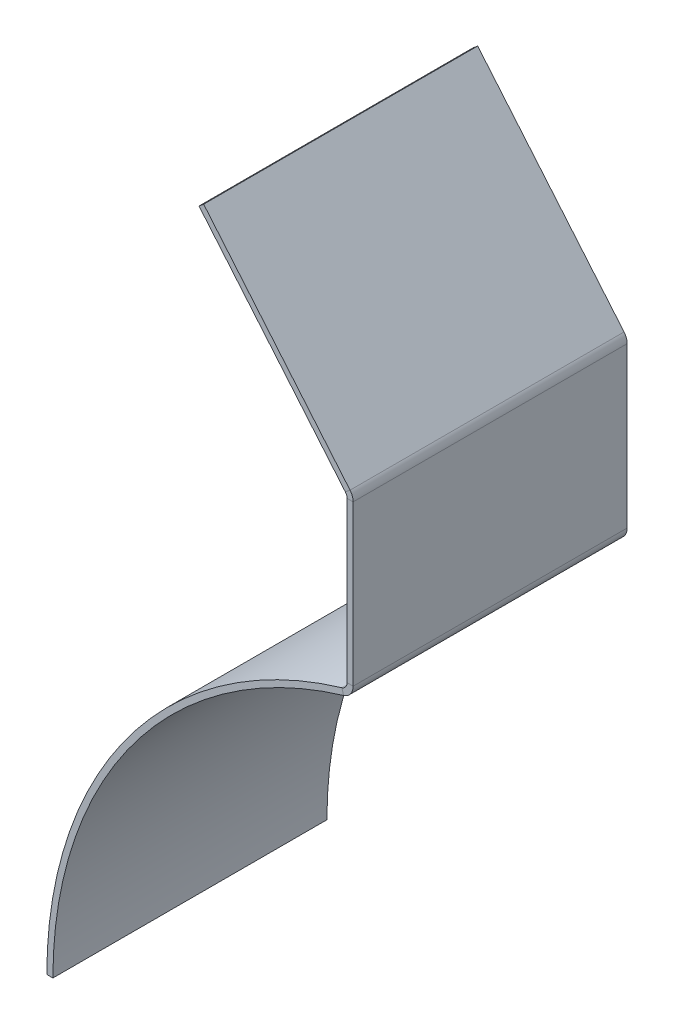
ISO-10303-21;
HEADER;
FILE_DESCRIPTION(('STEP AP214'),'2;1');
FILE_NAME('part.step','',(''),(''),'','','');
FILE_SCHEMA(('AUTOMOTIVE_DESIGN { 1 0 10303 214 1 1 1 1 }'));
ENDSEC;
DATA;
#1=APPLICATION_CONTEXT('core data for automotive mechanical design processes');
#2=APPLICATION_PROTOCOL_DEFINITION('international standard','automotive_design',2000,#1);
#3=PRODUCT_CONTEXT('',#1,'mechanical');
#4=PRODUCT('Part','Part','',(#3));
#5=PRODUCT_RELATED_PRODUCT_CATEGORY('part','',(#4));
#6=PRODUCT_DEFINITION_FORMATION('','',#4);
#7=PRODUCT_DEFINITION_CONTEXT('part definition',#1,'design');
#8=PRODUCT_DEFINITION('design','',#6,#7);
#9=PRODUCT_DEFINITION_SHAPE('','',#8);
#10=(LENGTH_UNIT() NAMED_UNIT(*) SI_UNIT(.MILLI.,.METRE.));
#11=(NAMED_UNIT(*) PLANE_ANGLE_UNIT() SI_UNIT($,.RADIAN.));
#12=(NAMED_UNIT(*) SI_UNIT($,.STERADIAN.) SOLID_ANGLE_UNIT());
#13=UNCERTAINTY_MEASURE_WITH_UNIT(LENGTH_MEASURE(1.E-05),#10,'distance_accuracy_value','');
#14=(GEOMETRIC_REPRESENTATION_CONTEXT(3) GLOBAL_UNCERTAINTY_ASSIGNED_CONTEXT((#13)) GLOBAL_UNIT_ASSIGNED_CONTEXT((#10,
#11,#12)) REPRESENTATION_CONTEXT('',''));
#15=CARTESIAN_POINT('',(0.,0.,0.));
#16=DIRECTION('',(0.,0.,1.));
#17=DIRECTION('',(1.,0.,0.));
#18=AXIS2_PLACEMENT_3D('',#15,#16,#17);
#19=CARTESIAN_POINT('',(-46.6343359967597,173.610704407755,0.));
#20=DIRECTION('',(0.,0.,-1.));
#21=DIRECTION('',(-1.,0.,0.));
#22=AXIS2_PLACEMENT_3D('',#19,#20,#21);
#23=PLANE('',#22);
#24=DIRECTION('',(-2.70456049815286E-05,0.999999999634268,0.));
#25=VECTOR('',#24,1.);
#26=CARTESIAN_POINT('',(-49.2864988407369,0.674769126515573,0.));
#27=LINE('',#26,#25);
#28=CARTESIAN_POINT('',(-49.2931259037528,245.707668850982,0.));
#29=VERTEX_POINT('',#28);
#30=CARTESIAN_POINT('',(-49.2912400011612,175.977204615524,0.));
#31=VERTEX_POINT('',#30);
#32=EDGE_CURVE('E265',#29,#31,#27,.F.);
#33=ORIENTED_EDGE('',*,*,#32,.F.);
#34=DIRECTION('',(0.999999999634268,2.70456049856609E-05,0.));
#35=VECTOR('',#34,1.);
#36=CARTESIAN_POINT('',(-49.2931259037528,245.707668850982,0.));
#37=LINE('',#36,#35);
#38=CARTESIAN_POINT('',(-46.6362859047245,245.707740706827,0.));
#39=VERTEX_POINT('',#38);
#40=EDGE_CURVE('E235',#29,#39,#37,.T.);
#41=ORIENTED_EDGE('',*,*,#40,.T.);
#42=DIRECTION('',(2.70456049815286E-05,-0.999999999634268,0.));
#43=VECTOR('',#42,1.);
#44=CARTESIAN_POINT('',(-46.6343359967597,173.610704407755,0.));
#45=LINE('',#44,#43);
#46=CARTESIAN_POINT('',(-46.6344000021329,175.977276471369,0.));
#47=VERTEX_POINT('',#46);
#48=EDGE_CURVE('E257',#39,#47,#45,.T.);
#49=ORIENTED_EDGE('',*,*,#48,.T.);
#50=DIRECTION('',(0.999999999634268,2.70456049815286E-05,0.));
#51=VECTOR('',#50,1.);
#52=CARTESIAN_POINT('',(-49.2912400011612,175.977204615524,0.));
#53=LINE('',#52,#51);
#54=EDGE_CURVE('E276',#31,#47,#53,.T.);
#55=ORIENTED_EDGE('',*,*,#54,.F.);
#56=EDGE_LOOP('',(#33,#41,#49,#55));
#57=FACE_BOUND('',#56,.T.);
#58=ADVANCED_FACE('F81',(#57),#23,.T.);
#59=CARTESIAN_POINT('',(-46.6296588417086,0.674840982360713,0.));
#60=DIRECTION('',(0.999999999634268,2.70456049815286E-05,0.));
#61=DIRECTION('',(-2.70456049815286E-05,0.999999999634268,0.));
#62=AXIS2_PLACEMENT_3D('',#59,#60,#61);
#63=PLANE('',#62);
#64=ORIENTED_EDGE('',*,*,#48,.F.);
#65=DIRECTION('',(0.,0.,-1.));
#66=VECTOR('',#65,1.);
#67=CARTESIAN_POINT('',(-46.6362859047245,245.707740706827,0.));
#68=LINE('',#67,#66);
#69=CARTESIAN_POINT('',(-46.6362859047245,245.707740706827,119.6975));
#70=VERTEX_POINT('',#69);
#71=EDGE_CURVE('E228',#39,#70,#68,.F.);
#72=ORIENTED_EDGE('',*,*,#71,.T.);
#73=DIRECTION('',(-2.70456049815286E-05,0.999999999634268,0.));
#74=VECTOR('',#73,1.);
#75=CARTESIAN_POINT('',(-46.636343312163,247.830356877054,119.6975));
#76=LINE('',#75,#74);
#77=CARTESIAN_POINT('',(-46.6344000021329,175.977276471369,119.6975));
#78=VERTEX_POINT('',#77);
#79=EDGE_CURVE('E261',#78,#70,#76,.T.);
#80=ORIENTED_EDGE('',*,*,#79,.F.);
#81=DIRECTION('',(0.,0.,-1.));
#82=VECTOR('',#81,1.);
#83=CARTESIAN_POINT('',(-46.6344000021329,175.977276471369,0.));
#84=LINE('',#83,#82);
#85=EDGE_CURVE('E272',#78,#47,#84,.T.);
#86=ORIENTED_EDGE('',*,*,#85,.T.);
#87=EDGE_LOOP('',(#64,#72,#80,#86));
#88=FACE_BOUND('',#87,.T.);
#89=ADVANCED_FACE('F369',(#88),#63,.T.);
#90=CARTESIAN_POINT('',(-49.2864988407369,0.674769126515573,0.));
#91=DIRECTION('',(0.999999999634268,2.70456049815286E-05,0.));
#92=DIRECTION('',(-2.70456049815286E-05,0.999999999634268,0.));
#93=AXIS2_PLACEMENT_3D('',#90,#91,#92);
#94=PLANE('',#93);
#95=DIRECTION('',(0.,0.,-1.));
#96=VECTOR('',#95,1.);
#97=CARTESIAN_POINT('',(-49.2931259037528,245.707668850982,0.));
#98=LINE('',#97,#96);
#99=CARTESIAN_POINT('',(-49.2931259037528,245.707668850982,119.6975));
#100=VERTEX_POINT('',#99);
#101=EDGE_CURVE('E243',#29,#100,#98,.F.);
#102=ORIENTED_EDGE('',*,*,#101,.F.);
#103=ORIENTED_EDGE('',*,*,#32,.T.);
#104=DIRECTION('',(0.,0.,1.));
#105=VECTOR('',#104,1.);
#106=CARTESIAN_POINT('',(-49.2912400011612,175.977204615524,119.6975));
#107=LINE('',#106,#105);
#108=CARTESIAN_POINT('',(-49.2912400011612,175.977204615524,119.6975));
#109=VERTEX_POINT('',#108);
#110=EDGE_CURVE('E280',#109,#31,#107,.F.);
#111=ORIENTED_EDGE('',*,*,#110,.F.);
#112=DIRECTION('',(2.70456049815286E-05,-0.999999999634268,0.));
#113=VECTOR('',#112,1.);
#114=CARTESIAN_POINT('',(-49.2864988407369,0.674769126515596,119.6975));
#115=LINE('',#114,#113);
#116=EDGE_CURVE('E268',#109,#100,#115,.F.);
#117=ORIENTED_EDGE('',*,*,#116,.T.);
#118=EDGE_LOOP('',(#102,#103,#111,#117));
#119=FACE_BOUND('',#118,.T.);
#120=ADVANCED_FACE('F358',(#119),#94,.F.);
#121=CARTESIAN_POINT('',(0.,0.,119.6975));
#122=DIRECTION('',(0.,0.,-1.));
#123=DIRECTION('',(-1.,0.,0.));
#124=AXIS2_PLACEMENT_3D('',#121,#122,#123);
#125=CYLINDRICAL_SURFACE('',#124,180.45684);
#126=CARTESIAN_POINT('',(0.,0.,0.));
#127=DIRECTION('',(0.,0.,1.));
#128=DIRECTION('',(1.,0.,0.));
#129=AXIS2_PLACEMENT_3D('',#126,#127,#128);
#130=CIRCLE('',#129,180.45684);
#131=CARTESIAN_POINT('',(-51.5590971428571,172.934469104916,0.));
#132=VERTEX_POINT('',#131);
#133=CARTESIAN_POINT('',(-180.45684,0.,0.));
#134=VERTEX_POINT('',#133);
#135=EDGE_CURVE('E291',#132,#134,#130,.T.);
#136=ORIENTED_EDGE('',*,*,#135,.T.);
#137=DIRECTION('',(0.,0.,-1.));
#138=VECTOR('',#137,1.);
#139=CARTESIAN_POINT('',(-180.45684,0.,119.6975));
#140=LINE('',#139,#138);
#141=CARTESIAN_POINT('',(-180.45684,0.,119.6975));
#142=VERTEX_POINT('',#141);
#143=EDGE_CURVE('E13',#142,#134,#140,.T.);
#144=ORIENTED_EDGE('',*,*,#143,.F.);
#145=CARTESIAN_POINT('',(0.,0.,119.6975));
#146=DIRECTION('',(0.,0.,1.));
#147=DIRECTION('',(1.,0.,0.));
#148=AXIS2_PLACEMENT_3D('',#145,#146,#147);
#149=CIRCLE('',#148,180.45684);
#150=CARTESIAN_POINT('',(-51.5590971428571,172.934469104916,119.6975));
#151=VERTEX_POINT('',#150);
#152=EDGE_CURVE('E106',#151,#142,#149,.T.);
#153=ORIENTED_EDGE('',*,*,#152,.F.);
#154=DIRECTION('',(0.,0.,-1.));
#155=VECTOR('',#154,1.);
#156=CARTESIAN_POINT('',(-51.5590971428571,172.934469104916,119.6975));
#157=LINE('',#156,#155);
#158=EDGE_CURVE('E122',#151,#132,#157,.T.);
#159=ORIENTED_EDGE('',*,*,#158,.T.);
#160=EDGE_LOOP('',(#136,#144,#153,#159));
#161=FACE_BOUND('',#160,.T.);
#162=ADVANCED_FACE('F83',(#161),#125,.T.);
#163=CARTESIAN_POINT('',(-177.8,0.,119.6975));
#164=DIRECTION('',(0.,-1.,0.));
#165=DIRECTION('',(1.,0.,0.));
#166=AXIS2_PLACEMENT_3D('',#163,#164,#165);
#167=PLANE('',#166);
#168=DIRECTION('',(-1.,0.,0.));
#169=VECTOR('',#168,1.);
#170=CARTESIAN_POINT('',(-177.8,0.,0.));
#171=LINE('',#170,#169);
#172=CARTESIAN_POINT('',(-177.8,0.,0.));
#173=VERTEX_POINT('',#172);
#174=EDGE_CURVE('E320',#173,#134,#171,.T.);
#175=ORIENTED_EDGE('',*,*,#174,.F.);
#176=DIRECTION('',(0.,0.,-1.));
#177=VECTOR('',#176,1.);
#178=CARTESIAN_POINT('',(-177.8,0.,119.6975));
#179=LINE('',#178,#177);
#180=CARTESIAN_POINT('',(-177.8,0.,119.6975));
#181=VERTEX_POINT('',#180);
#182=EDGE_CURVE('E90',#181,#173,#179,.T.);
#183=ORIENTED_EDGE('',*,*,#182,.F.);
#184=DIRECTION('',(-1.,0.,0.));
#185=VECTOR('',#184,1.);
#186=CARTESIAN_POINT('',(-177.8,0.,119.6975));
#187=LINE('',#186,#185);
#188=EDGE_CURVE('E305',#181,#142,#187,.T.);
#189=ORIENTED_EDGE('',*,*,#188,.T.);
#190=ORIENTED_EDGE('',*,*,#143,.T.);
#191=EDGE_LOOP('',(#175,#183,#189,#190));
#192=FACE_BOUND('',#191,.T.);
#193=ADVANCED_FACE('F342',(#192),#167,.T.);
#194=CARTESIAN_POINT('',(0.,0.,119.6975));
#195=DIRECTION('',(0.,0.,-1.));
#196=DIRECTION('',(-1.,0.,0.));
#197=AXIS2_PLACEMENT_3D('',#194,#195,#196);
#198=CYLINDRICAL_SURFACE('',#197,177.8);
#199=CARTESIAN_POINT('',(0.,0.,0.));
#200=DIRECTION('',(0.,0.,1.));
#201=DIRECTION('',(1.,0.,0.));
#202=AXIS2_PLACEMENT_3D('',#199,#200,#201);
#203=CIRCLE('',#202,177.8);
#204=CARTESIAN_POINT('',(-50.8,170.388379885484,0.));
#205=VERTEX_POINT('',#204);
#206=EDGE_CURVE('E324',#205,#173,#203,.T.);
#207=ORIENTED_EDGE('',*,*,#206,.F.);
#208=DIRECTION('',(0.,0.,-1.));
#209=VECTOR('',#208,1.);
#210=CARTESIAN_POINT('',(-50.8,170.388379885484,119.6975));
#211=LINE('',#210,#209);
#212=CARTESIAN_POINT('',(-50.8,170.388379885484,119.6975));
#213=VERTEX_POINT('',#212);
#214=EDGE_CURVE('E332',#213,#205,#211,.T.);
#215=ORIENTED_EDGE('',*,*,#214,.F.);
#216=CARTESIAN_POINT('',(0.,0.,119.6975));
#217=DIRECTION('',(0.,0.,1.));
#218=DIRECTION('',(1.,0.,0.));
#219=AXIS2_PLACEMENT_3D('',#216,#217,#218);
#220=CIRCLE('',#219,177.8);
#221=EDGE_CURVE('E310',#213,#181,#220,.T.);
#222=ORIENTED_EDGE('',*,*,#221,.T.);
#223=ORIENTED_EDGE('',*,*,#182,.T.);
#224=EDGE_LOOP('',(#207,#215,#222,#223));
#225=FACE_BOUND('',#224,.T.);
#226=ADVANCED_FACE('F339',(#225),#198,.F.);
#227=CARTESIAN_POINT('',(0.,0.,119.6975));
#228=DIRECTION('',(0.,0.,1.));
#229=DIRECTION('',(1.,0.,0.));
#230=AXIS2_PLACEMENT_3D('',#227,#228,#229);
#231=PLANE('',#230);
#232=ORIENTED_EDGE('',*,*,#152,.T.);
#233=ORIENTED_EDGE('',*,*,#188,.F.);
#234=ORIENTED_EDGE('',*,*,#221,.F.);
#235=DIRECTION('',(0.285714285714285,-0.95831484749991,0.));
#236=VECTOR('',#235,1.);
#237=CARTESIAN_POINT('',(-51.5590971428571,172.934469104916,119.6975));
#238=LINE('',#237,#236);
#239=EDGE_CURVE('E314',#151,#213,#238,.T.);
#240=ORIENTED_EDGE('',*,*,#239,.F.);
#241=EDGE_LOOP('',(#232,#233,#234,#240));
#242=FACE_BOUND('',#241,.T.);
#243=ADVANCED_FACE('F381',(#242),#231,.T.);
#244=CARTESIAN_POINT('',(0.,0.,0.));
#245=DIRECTION('',(0.,0.,1.));
#246=DIRECTION('',(1.,0.,0.));
#247=AXIS2_PLACEMENT_3D('',#244,#245,#246);
#248=PLANE('',#247);
#249=ORIENTED_EDGE('',*,*,#135,.F.);
#250=DIRECTION('',(0.285714285714285,-0.95831484749991,0.));
#251=VECTOR('',#250,1.);
#252=CARTESIAN_POINT('',(-51.5590971428571,172.934469104916,0.));
#253=LINE('',#252,#251);
#254=EDGE_CURVE('E306',#132,#205,#253,.T.);
#255=ORIENTED_EDGE('',*,*,#254,.T.);
#256=ORIENTED_EDGE('',*,*,#206,.T.);
#257=ORIENTED_EDGE('',*,*,#174,.T.);
#258=EDGE_LOOP('',(#249,#255,#256,#257));
#259=FACE_BOUND('',#258,.T.);
#260=ADVANCED_FACE('F344',(#259),#248,.F.);
#261=CARTESIAN_POINT('',(-52.46624,175.977118745728,119.6975));
#262=DIRECTION('',(0.,0.,1.));
#263=DIRECTION('',(1.,0.,0.));
#264=AXIS2_PLACEMENT_3D('',#261,#262,#263);
#265=PLANE('',#264);
#266=DIRECTION('',(0.999999999634268,2.70456049815286E-05,0.));
#267=VECTOR('',#266,1.);
#268=CARTESIAN_POINT('',(-46.6344000021329,175.977276471369,119.6975));
#269=LINE('',#268,#267);
#270=EDGE_CURVE('E253',#109,#78,#269,.T.);
#271=ORIENTED_EDGE('',*,*,#270,.F.);
#272=CARTESIAN_POINT('',(-52.46624,175.977118745728,119.6975));
#273=DIRECTION('',(0.,0.,-1.));
#274=DIRECTION('',(-1.,0.,0.));
#275=AXIS2_PLACEMENT_3D('',#272,#273,#274);
#276=CIRCLE('',#275,3.17499999999999);
#277=EDGE_CURVE('E296',#151,#109,#276,.F.);
#278=ORIENTED_EDGE('',*,*,#277,.F.);
#279=ORIENTED_EDGE('',*,*,#239,.T.);
#280=CARTESIAN_POINT('',(-52.46624,175.977118745728,119.6975));
#281=DIRECTION('',(0.,0.,-1.));
#282=DIRECTION('',(-1.,0.,0.));
#283=AXIS2_PLACEMENT_3D('',#280,#281,#282);
#284=CIRCLE('',#283,5.83183999999999);
#285=EDGE_CURVE('E287',#213,#78,#284,.F.);
#286=ORIENTED_EDGE('',*,*,#285,.T.);
#287=EDGE_LOOP('',(#271,#278,#279,#286));
#288=FACE_BOUND('',#287,.T.);
#289=ADVANCED_FACE('F380',(#288),#265,.T.);
#290=CARTESIAN_POINT('',(-52.46624,175.977118745728,0.));
#291=DIRECTION('',(0.,0.,1.));
#292=DIRECTION('',(1.,0.,0.));
#293=AXIS2_PLACEMENT_3D('',#290,#291,#292);
#294=PLANE('',#293);
#295=CARTESIAN_POINT('',(-52.46624,175.977118745728,0.));
#296=DIRECTION('',(0.,0.,-1.));
#297=DIRECTION('',(-1.,0.,0.));
#298=AXIS2_PLACEMENT_3D('',#295,#296,#297);
#299=CIRCLE('',#298,3.17499999999999);
#300=EDGE_CURVE('E260',#31,#132,#299,.T.);
#301=ORIENTED_EDGE('',*,*,#300,.F.);
#302=ORIENTED_EDGE('',*,*,#54,.T.);
#303=CARTESIAN_POINT('',(-52.46624,175.977118745728,0.));
#304=DIRECTION('',(0.,0.,-1.));
#305=DIRECTION('',(-1.,0.,0.));
#306=AXIS2_PLACEMENT_3D('',#303,#304,#305);
#307=CIRCLE('',#306,5.83183999999999);
#308=EDGE_CURVE('E292',#47,#205,#307,.T.);
#309=ORIENTED_EDGE('',*,*,#308,.T.);
#310=ORIENTED_EDGE('',*,*,#254,.F.);
#311=EDGE_LOOP('',(#301,#302,#309,#310));
#312=FACE_BOUND('',#311,.T.);
#313=ADVANCED_FACE('F348',(#312),#294,.F.);
#314=CARTESIAN_POINT('',(-52.46624,175.977118745728,0.));
#315=DIRECTION('',(0.,0.,-1.));
#316=DIRECTION('',(0.999999999634268,2.70456049815286E-05,0.));
#317=AXIS2_PLACEMENT_3D('',#314,#315,#316);
#318=CYLINDRICAL_SURFACE('',#317,5.83183999999999);
#319=ORIENTED_EDGE('',*,*,#214,.T.);
#320=ORIENTED_EDGE('',*,*,#308,.F.);
#321=ORIENTED_EDGE('',*,*,#85,.F.);
#322=ORIENTED_EDGE('',*,*,#285,.F.);
#323=EDGE_LOOP('',(#319,#320,#321,#322));
#324=FACE_BOUND('',#323,.T.);
#325=ADVANCED_FACE('F378',(#324),#318,.T.);
#326=CARTESIAN_POINT('',(-52.46624,175.977118745728,0.));
#327=DIRECTION('',(0.,0.,-1.));
#328=DIRECTION('',(0.999999999634268,2.70456049815286E-05,0.));
#329=AXIS2_PLACEMENT_3D('',#326,#327,#328);
#330=CYLINDRICAL_SURFACE('',#329,3.17499999999999);
#331=ORIENTED_EDGE('',*,*,#158,.F.);
#332=ORIENTED_EDGE('',*,*,#277,.T.);
#333=ORIENTED_EDGE('',*,*,#110,.T.);
#334=ORIENTED_EDGE('',*,*,#300,.T.);
#335=EDGE_LOOP('',(#331,#332,#333,#334));
#336=FACE_BOUND('',#335,.T.);
#337=ADVANCED_FACE('F352',(#336),#330,.F.);
#338=CARTESIAN_POINT('',(-46.636343312163,247.830356877054,119.6975));
#339=DIRECTION('',(0.,0.,1.));
#340=DIRECTION('',(0.,-1.,0.));
#341=AXIS2_PLACEMENT_3D('',#338,#339,#340);
#342=PLANE('',#341);
#343=DIRECTION('',(0.999999999634268,2.70456049856609E-05,0.));
#344=VECTOR('',#343,1.);
#345=CARTESIAN_POINT('',(-49.2931259037528,245.707668850982,119.6975));
#346=LINE('',#345,#344);
#347=EDGE_CURVE('E250',#100,#70,#346,.T.);
#348=ORIENTED_EDGE('',*,*,#347,.F.);
#349=ORIENTED_EDGE('',*,*,#116,.F.);
#350=ORIENTED_EDGE('',*,*,#270,.T.);
#351=ORIENTED_EDGE('',*,*,#79,.T.);
#352=EDGE_LOOP('',(#348,#349,#350,#351));
#353=FACE_BOUND('',#352,.T.);
#354=ADVANCED_FACE('F362',(#353),#342,.T.);
#355=CARTESIAN_POINT('',(-52.4681259025916,245.707582981186,119.6975));
#356=DIRECTION('',(0.,0.,1.));
#357=DIRECTION('',(1.,0.,0.));
#358=AXIS2_PLACEMENT_3D('',#355,#356,#357);
#359=PLANE('',#358);
#360=DIRECTION('',(-0.766027058259036,-0.642808327586854,0.));
#361=VECTOR('',#360,1.);
#362=CARTESIAN_POINT('',(-48.0007786631542,249.456338298341,119.6975));
#363=LINE('',#362,#361);
#364=CARTESIAN_POINT('',(-50.0359899926192,247.748499421275,119.6975));
#365=VERTEX_POINT('',#364);
#366=CARTESIAN_POINT('',(-48.0007786631542,249.456338298341,119.6975));
#367=VERTEX_POINT('',#366);
#368=EDGE_CURVE('E202',#365,#367,#363,.F.);
#369=ORIENTED_EDGE('',*,*,#368,.F.);
#370=CARTESIAN_POINT('',(-52.4681259025916,245.707582981186,119.6975));
#371=DIRECTION('',(0.,0.,-1.));
#372=DIRECTION('',(-1.,0.,0.));
#373=AXIS2_PLACEMENT_3D('',#370,#371,#372);
#374=CIRCLE('',#373,3.17500000000002);
#375=EDGE_CURVE('E239',#100,#365,#374,.F.);
#376=ORIENTED_EDGE('',*,*,#375,.F.);
#377=ORIENTED_EDGE('',*,*,#347,.T.);
#378=CARTESIAN_POINT('',(-52.4681259025916,245.707582981186,119.6975));
#379=DIRECTION('',(0.,0.,-1.));
#380=DIRECTION('',(-1.,0.,0.));
#381=AXIS2_PLACEMENT_3D('',#378,#379,#380);
#382=CIRCLE('',#381,5.83184000000002);
#383=EDGE_CURVE('E97',#70,#367,#382,.F.);
#384=ORIENTED_EDGE('',*,*,#383,.T.);
#385=EDGE_LOOP('',(#369,#376,#377,#384));
#386=FACE_BOUND('',#385,.T.);
#387=ADVANCED_FACE('F366',(#386),#359,.T.);
#388=CARTESIAN_POINT('',(-52.4681259025916,245.707582981186,0.));
#389=DIRECTION('',(0.,0.,1.));
#390=DIRECTION('',(1.,0.,0.));
#391=AXIS2_PLACEMENT_3D('',#388,#389,#390);
#392=PLANE('',#391);
#393=CARTESIAN_POINT('',(-52.4681259025916,245.707582981186,0.));
#394=DIRECTION('',(0.,0.,-1.));
#395=DIRECTION('',(-1.,0.,0.));
#396=AXIS2_PLACEMENT_3D('',#393,#394,#395);
#397=CIRCLE('',#396,3.17500000000002);
#398=CARTESIAN_POINT('',(-50.0359899926192,247.748499421275,0.));
#399=VERTEX_POINT('',#398);
#400=EDGE_CURVE('E246',#399,#29,#397,.T.);
#401=ORIENTED_EDGE('',*,*,#400,.F.);
#402=DIRECTION('',(-0.766027058259036,-0.642808327586854,0.));
#403=VECTOR('',#402,1.);
#404=CARTESIAN_POINT('',(-50.0359899926192,247.748499421275,0.));
#405=LINE('',#404,#403);
#406=CARTESIAN_POINT('',(-48.0007786631543,249.456338298341,0.));
#407=VERTEX_POINT('',#406);
#408=EDGE_CURVE('E219',#399,#407,#405,.F.);
#409=ORIENTED_EDGE('',*,*,#408,.T.);
#410=CARTESIAN_POINT('',(-52.4681259025916,245.707582981186,0.));
#411=DIRECTION('',(0.,0.,-1.));
#412=DIRECTION('',(-1.,0.,0.));
#413=AXIS2_PLACEMENT_3D('',#410,#411,#412);
#414=CIRCLE('',#413,5.83184000000002);
#415=EDGE_CURVE('E232',#407,#39,#414,.T.);
#416=ORIENTED_EDGE('',*,*,#415,.T.);
#417=ORIENTED_EDGE('',*,*,#40,.F.);
#418=EDGE_LOOP('',(#401,#409,#416,#417));
#419=FACE_BOUND('',#418,.T.);
#420=ADVANCED_FACE('F373',(#419),#392,.F.);
#421=CARTESIAN_POINT('',(-52.4681259025916,245.707582981186,0.));
#422=DIRECTION('',(0.,0.,-1.));
#423=DIRECTION('',(0.766027058259036,0.642808327586854,0.));
#424=AXIS2_PLACEMENT_3D('',#421,#422,#423);
#425=CYLINDRICAL_SURFACE('',#424,5.83184000000002);
#426=ORIENTED_EDGE('',*,*,#71,.F.);
#427=ORIENTED_EDGE('',*,*,#415,.F.);
#428=DIRECTION('',(0.,0.,-1.));
#429=VECTOR('',#428,1.);
#430=CARTESIAN_POINT('',(-48.0007786631542,249.456338298341,119.6975));
#431=LINE('',#430,#429);
#432=EDGE_CURVE('E216',#407,#367,#431,.F.);
#433=ORIENTED_EDGE('',*,*,#432,.T.);
#434=ORIENTED_EDGE('',*,*,#383,.F.);
#435=EDGE_LOOP('',(#426,#427,#433,#434));
#436=FACE_BOUND('',#435,.T.);
#437=ADVANCED_FACE('F370',(#436),#425,.T.);
#438=CARTESIAN_POINT('',(-52.4681259025916,245.707582981186,0.));
#439=DIRECTION('',(0.,0.,-1.));
#440=DIRECTION('',(0.766027058259036,0.642808327586854,0.));
#441=AXIS2_PLACEMENT_3D('',#438,#439,#440);
#442=CYLINDRICAL_SURFACE('',#441,3.17500000000002);
#443=ORIENTED_EDGE('',*,*,#101,.T.);
#444=ORIENTED_EDGE('',*,*,#375,.T.);
#445=DIRECTION('',(0.,0.,-1.));
#446=VECTOR('',#445,1.);
#447=CARTESIAN_POINT('',(-50.0359899926192,247.748499421275,119.6975));
#448=LINE('',#447,#446);
#449=EDGE_CURVE('E223',#365,#399,#448,.T.);
#450=ORIENTED_EDGE('',*,*,#449,.T.);
#451=ORIENTED_EDGE('',*,*,#400,.T.);
#452=EDGE_LOOP('',(#443,#444,#450,#451));
#453=FACE_BOUND('',#452,.T.);
#454=ADVANCED_FACE('F442',(#453),#442,.F.);
#455=CARTESIAN_POINT('',(-47.2579458283376,248.571113221421,119.6975));
#456=DIRECTION('',(0.,0.,-1.));
#457=DIRECTION('',(-1.,0.,0.));
#458=AXIS2_PLACEMENT_3D('',#455,#456,#457);
#459=PLANE('',#458);
#460=ORIENTED_EDGE('',*,*,#368,.T.);
#461=DIRECTION('',(0.642808327586854,-0.766027058259036,0.));
#462=VECTOR('',#461,1.);
#463=CARTESIAN_POINT('',(95.1438798136732,78.8725469368593,119.6975));
#464=LINE('',#463,#462);
#465=CARTESIAN_POINT('',(-111.945669394987,325.658705996172,119.6975));
#466=VERTEX_POINT('',#465);
#467=EDGE_CURVE('E181',#466,#367,#464,.T.);
#468=ORIENTED_EDGE('',*,*,#467,.F.);
#469=DIRECTION('',(-0.766027058259036,-0.642808327586854,0.));
#470=VECTOR('',#469,1.);
#471=CARTESIAN_POINT('',(-111.945669394987,325.658705996172,119.6975));
#472=LINE('',#471,#470);
#473=CARTESIAN_POINT('',(-113.980880724452,323.950867119106,119.6975));
#474=VERTEX_POINT('',#473);
#475=EDGE_CURVE('E188',#466,#474,#472,.T.);
#476=ORIENTED_EDGE('',*,*,#475,.T.);
#477=DIRECTION('',(-0.642808327586854,0.766027058259036,0.));
#478=VECTOR('',#477,1.);
#479=CARTESIAN_POINT('',(-49.2931571578025,246.863274344355,119.6975));
#480=LINE('',#479,#478);
#481=EDGE_CURVE('E213',#474,#365,#480,.F.);
#482=ORIENTED_EDGE('',*,*,#481,.T.);
#483=EDGE_LOOP('',(#460,#468,#476,#482));
#484=FACE_BOUND('',#483,.T.);
#485=ADVANCED_FACE('F201',(#484),#459,.F.);
#486=CARTESIAN_POINT('',(-111.945669394987,325.658705996172,0.));
#487=DIRECTION('',(0.,0.,1.));
#488=DIRECTION('',(1.,0.,0.));
#489=AXIS2_PLACEMENT_3D('',#486,#487,#488);
#490=PLANE('',#489);
#491=ORIENTED_EDGE('',*,*,#408,.F.);
#492=DIRECTION('',(0.642808327586854,-0.766027058259036,0.));
#493=VECTOR('',#492,1.);
#494=CARTESIAN_POINT('',(-113.980880724452,323.950867119106,0.));
#495=LINE('',#494,#493);
#496=CARTESIAN_POINT('',(-113.980880724452,323.950867119106,0.));
#497=VERTEX_POINT('',#496);
#498=EDGE_CURVE('E208',#399,#497,#495,.F.);
#499=ORIENTED_EDGE('',*,*,#498,.T.);
#500=DIRECTION('',(-0.766027058259036,-0.642808327586854,0.));
#501=VECTOR('',#500,1.);
#502=CARTESIAN_POINT('',(-111.945669394987,325.658705996172,0.));
#503=LINE('',#502,#501);
#504=CARTESIAN_POINT('',(-111.945669394987,325.658705996172,0.));
#505=VERTEX_POINT('',#504);
#506=EDGE_CURVE('E198',#505,#497,#503,.T.);
#507=ORIENTED_EDGE('',*,*,#506,.F.);
#508=DIRECTION('',(-0.642808327586854,0.766027058259036,0.));
#509=VECTOR('',#508,1.);
#510=CARTESIAN_POINT('',(95.1438798136732,78.8725469368593,0.));
#511=LINE('',#510,#509);
#512=EDGE_CURVE('E183',#407,#505,#511,.T.);
#513=ORIENTED_EDGE('',*,*,#512,.F.);
#514=EDGE_LOOP('',(#491,#499,#507,#513));
#515=FACE_BOUND('',#514,.T.);
#516=ADVANCED_FACE('F456',(#515),#490,.F.);
#517=CARTESIAN_POINT('',(95.1438798136732,78.8725469368593,0.));
#518=DIRECTION('',(-0.766027058259036,-0.642808327586854,0.));
#519=DIRECTION('',(0.642808327586854,-0.766027058259036,0.));
#520=AXIS2_PLACEMENT_3D('',#517,#518,#519);
#521=PLANE('',#520);
#522=ORIENTED_EDGE('',*,*,#432,.F.);
#523=ORIENTED_EDGE('',*,*,#512,.T.);
#524=DIRECTION('',(0.,0.,1.));
#525=VECTOR('',#524,1.);
#526=CARTESIAN_POINT('',(-111.945669394987,325.658705996172,0.));
#527=LINE('',#526,#525);
#528=EDGE_CURVE('E176',#505,#466,#527,.T.);
#529=ORIENTED_EDGE('',*,*,#528,.T.);
#530=ORIENTED_EDGE('',*,*,#467,.T.);
#531=EDGE_LOOP('',(#522,#523,#529,#530));
#532=FACE_BOUND('',#531,.T.);
#533=ADVANCED_FACE('F179',(#532),#521,.F.);
#534=CARTESIAN_POINT('',(93.1086684842083,77.1647080597935,0.));
#535=DIRECTION('',(-0.766027058259036,-0.642808327586854,0.));
#536=DIRECTION('',(0.642808327586854,-0.766027058259036,0.));
#537=AXIS2_PLACEMENT_3D('',#534,#535,#536);
#538=PLANE('',#537);
#539=ORIENTED_EDGE('',*,*,#498,.F.);
#540=ORIENTED_EDGE('',*,*,#449,.F.);
#541=ORIENTED_EDGE('',*,*,#481,.F.);
#542=DIRECTION('',(0.,0.,-1.));
#543=VECTOR('',#542,1.);
#544=CARTESIAN_POINT('',(-113.980880724452,323.950867119106,119.6975));
#545=LINE('',#544,#543);
#546=EDGE_CURVE('E193',#497,#474,#545,.F.);
#547=ORIENTED_EDGE('',*,*,#546,.F.);
#548=EDGE_LOOP('',(#539,#540,#541,#547));
#549=FACE_BOUND('',#548,.T.);
#550=ADVANCED_FACE('F470',(#549),#538,.T.);
#551=CARTESIAN_POINT('',(-111.945669394987,325.658705996172,119.6975));
#552=DIRECTION('',(0.642808327586854,-0.766027058259036,0.));
#553=DIRECTION('',(0.766027058259036,0.642808327586854,0.));
#554=AXIS2_PLACEMENT_3D('',#551,#552,#553);
#555=PLANE('',#554);
#556=ORIENTED_EDGE('',*,*,#546,.T.);
#557=ORIENTED_EDGE('',*,*,#475,.F.);
#558=ORIENTED_EDGE('',*,*,#528,.F.);
#559=ORIENTED_EDGE('',*,*,#506,.T.);
#560=EDGE_LOOP('',(#556,#557,#558,#559));
#561=FACE_BOUND('',#560,.T.);
#562=ADVANCED_FACE('F191',(#561),#555,.F.);
#563=CLOSED_SHELL('',(#58,#89,#120,#162,#193,#226,#243,#260,#289,#313,#325,#337,#354,#387,#420,
#437,#454,#485,#516,#533,#550,#562));
#564=MANIFOLD_SOLID_BREP('B2',#563);
#565=ADVANCED_BREP_SHAPE_REPRESENTATION('',(#18,#564),#14);
#566=SHAPE_DEFINITION_REPRESENTATION(#9,#565);
ENDSEC;
END-ISO-10303-21;
